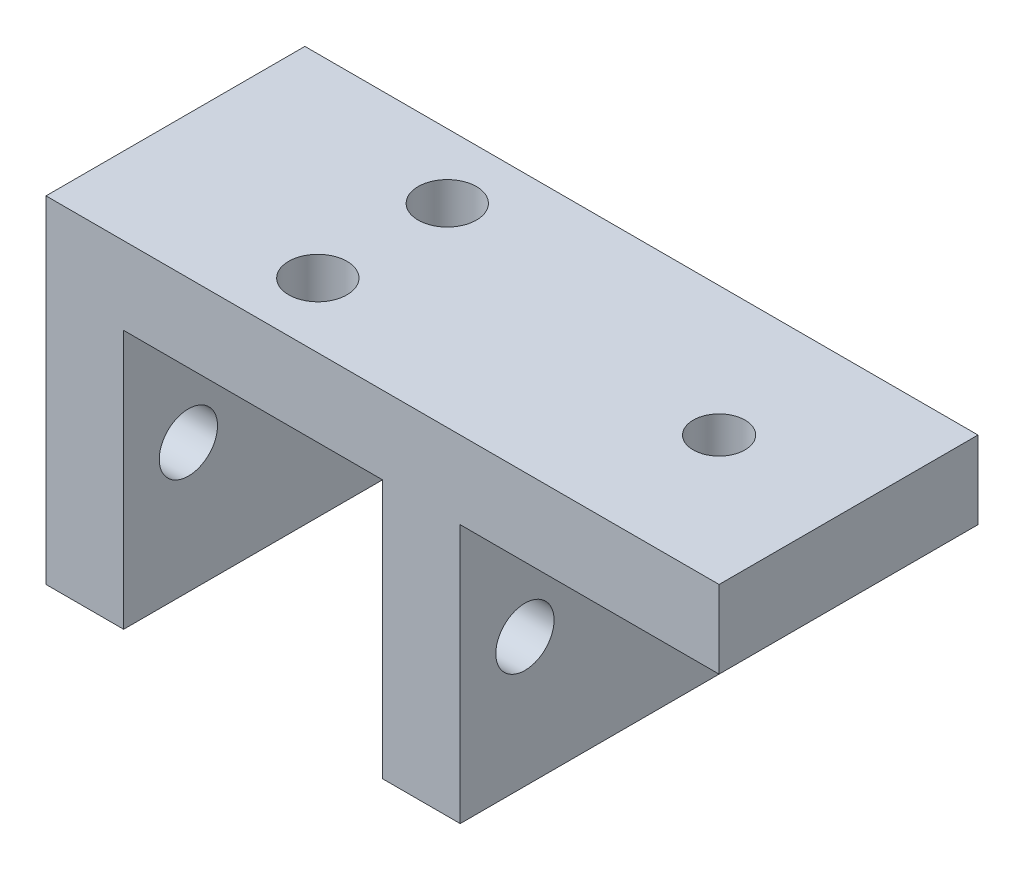
ISO-10303-21;
HEADER;
FILE_DESCRIPTION(('STEP AP214'),'2;1');
FILE_NAME('part.step','',(''),(''),'','','');
FILE_SCHEMA(('AUTOMOTIVE_DESIGN { 1 0 10303 214 1 1 1 1 }'));
ENDSEC;
DATA;
#1=APPLICATION_CONTEXT('core data for automotive mechanical design processes');
#2=APPLICATION_PROTOCOL_DEFINITION('international standard','automotive_design',2000,#1);
#3=PRODUCT_CONTEXT('',#1,'mechanical');
#4=PRODUCT('Part','Part','',(#3));
#5=PRODUCT_RELATED_PRODUCT_CATEGORY('part','',(#4));
#6=PRODUCT_DEFINITION_FORMATION('','',#4);
#7=PRODUCT_DEFINITION_CONTEXT('part definition',#1,'design');
#8=PRODUCT_DEFINITION('design','',#6,#7);
#9=PRODUCT_DEFINITION_SHAPE('','',#8);
#10=(LENGTH_UNIT() NAMED_UNIT(*) SI_UNIT(.MILLI.,.METRE.));
#11=(NAMED_UNIT(*) PLANE_ANGLE_UNIT() SI_UNIT($,.RADIAN.));
#12=(NAMED_UNIT(*) SI_UNIT($,.STERADIAN.) SOLID_ANGLE_UNIT());
#13=UNCERTAINTY_MEASURE_WITH_UNIT(LENGTH_MEASURE(1.E-05),#10,'distance_accuracy_value','');
#14=(GEOMETRIC_REPRESENTATION_CONTEXT(3) GLOBAL_UNCERTAINTY_ASSIGNED_CONTEXT((#13)) GLOBAL_UNIT_ASSIGNED_CONTEXT((#10,
#11,#12)) REPRESENTATION_CONTEXT('',''));
#15=CARTESIAN_POINT('',(0.,0.,0.));
#16=DIRECTION('',(0.,0.,1.));
#17=DIRECTION('',(1.,0.,0.));
#18=AXIS2_PLACEMENT_3D('',#15,#16,#17);
#19=CARTESIAN_POINT('',(-46.,-26.,20.));
#20=DIRECTION('',(0.,1.,0.));
#21=DIRECTION('',(0.,0.,1.));
#22=AXIS2_PLACEMENT_3D('',#19,#20,#21);
#23=PLANE('',#22);
#24=DIRECTION('',(1.,0.,0.));
#25=VECTOR('',#24,1.);
#26=CARTESIAN_POINT('',(-46.,-26.,0.));
#27=LINE('',#26,#25);
#28=CARTESIAN_POINT('',(-52.,-26.,0.));
#29=VERTEX_POINT('',#28);
#30=CARTESIAN_POINT('',(-46.,-26.,0.));
#31=VERTEX_POINT('',#30);
#32=EDGE_CURVE('E145',#29,#31,#27,.T.);
#33=ORIENTED_EDGE('',*,*,#32,.T.);
#34=DIRECTION('',(0.,0.,-1.));
#35=VECTOR('',#34,1.);
#36=CARTESIAN_POINT('',(-46.,-26.,20.));
#37=LINE('',#36,#35);
#38=CARTESIAN_POINT('',(-46.,-26.,20.));
#39=VERTEX_POINT('',#38);
#40=EDGE_CURVE('E11',#39,#31,#37,.T.);
#41=ORIENTED_EDGE('',*,*,#40,.F.);
#42=DIRECTION('',(1.,0.,0.));
#43=VECTOR('',#42,1.);
#44=CARTESIAN_POINT('',(-46.,-26.,20.));
#45=LINE('',#44,#43);
#46=CARTESIAN_POINT('',(-52.,-26.,20.));
#47=VERTEX_POINT('',#46);
#48=EDGE_CURVE('E164',#47,#39,#45,.T.);
#49=ORIENTED_EDGE('',*,*,#48,.F.);
#50=DIRECTION('',(0.,0.,-1.));
#51=VECTOR('',#50,1.);
#52=CARTESIAN_POINT('',(-52.,-26.,20.));
#53=LINE('',#52,#51);
#54=EDGE_CURVE('E141',#47,#29,#53,.T.);
#55=ORIENTED_EDGE('',*,*,#54,.T.);
#56=EDGE_LOOP('',(#33,#41,#49,#55));
#57=FACE_BOUND('',#56,.T.);
#58=ADVANCED_FACE('F37',(#57),#23,.F.);
#59=CARTESIAN_POINT('',(-46.,-6.,20.));
#60=DIRECTION('',(-1.,0.,0.));
#61=DIRECTION('',(0.,-1.,0.));
#62=AXIS2_PLACEMENT_3D('',#59,#60,#61);
#63=PLANE('',#62);
#64=CARTESIAN_POINT('',(-46.,-16.,15.));
#65=DIRECTION('',(-1.,0.,0.));
#66=DIRECTION('',(0.,-1.,0.));
#67=AXIS2_PLACEMENT_3D('',#64,#65,#66);
#68=CIRCLE('',#67,2.25);
#69=CARTESIAN_POINT('',(-46.,-18.25,15.));
#70=VERTEX_POINT('',#69);
#71=EDGE_CURVE('E149',#70,#70,#68,.T.);
#72=ORIENTED_EDGE('',*,*,#71,.T.);
#73=EDGE_LOOP('',(#72));
#74=FACE_BOUND('',#73,.T.);
#75=CARTESIAN_POINT('',(-46.,-16.,5.));
#76=DIRECTION('',(-1.,0.,0.));
#77=DIRECTION('',(0.,-1.,0.));
#78=AXIS2_PLACEMENT_3D('',#75,#76,#77);
#79=CIRCLE('',#78,2.25);
#80=CARTESIAN_POINT('',(-46.,-18.25,5.));
#81=VERTEX_POINT('',#80);
#82=EDGE_CURVE('E219',#81,#81,#79,.T.);
#83=ORIENTED_EDGE('',*,*,#82,.T.);
#84=EDGE_LOOP('',(#83));
#85=FACE_BOUND('',#84,.T.);
#86=DIRECTION('',(0.,1.,0.));
#87=VECTOR('',#86,1.);
#88=CARTESIAN_POINT('',(-46.,-6.,0.));
#89=LINE('',#88,#87);
#90=CARTESIAN_POINT('',(-46.,-6.,0.));
#91=VERTEX_POINT('',#90);
#92=EDGE_CURVE('E148',#31,#91,#89,.T.);
#93=ORIENTED_EDGE('',*,*,#92,.T.);
#94=DIRECTION('',(0.,0.,-1.));
#95=VECTOR('',#94,1.);
#96=CARTESIAN_POINT('',(-46.,-6.,20.));
#97=LINE('',#96,#95);
#98=CARTESIAN_POINT('',(-46.,-6.,20.));
#99=VERTEX_POINT('',#98);
#100=EDGE_CURVE('E45',#99,#91,#97,.T.);
#101=ORIENTED_EDGE('',*,*,#100,.F.);
#102=DIRECTION('',(0.,1.,0.));
#103=VECTOR('',#102,1.);
#104=CARTESIAN_POINT('',(-46.,-6.,20.));
#105=LINE('',#104,#103);
#106=EDGE_CURVE('E102',#39,#99,#105,.T.);
#107=ORIENTED_EDGE('',*,*,#106,.F.);
#108=ORIENTED_EDGE('',*,*,#40,.T.);
#109=EDGE_LOOP('',(#93,#101,#107,#108));
#110=FACE_BOUND('',#109,.T.);
#111=ADVANCED_FACE('F285',(#74,#85,#110),#63,.F.);
#112=CARTESIAN_POINT('',(-26.,-6.,20.));
#113=DIRECTION('',(0.,1.,0.));
#114=DIRECTION('',(-1.,0.,0.));
#115=AXIS2_PLACEMENT_3D('',#112,#113,#114);
#116=PLANE('',#115);
#117=CARTESIAN_POINT('',(-36.,-5.99999999999999,5.));
#118=DIRECTION('',(0.,-1.,0.));
#119=DIRECTION('',(0.,0.,-1.));
#120=AXIS2_PLACEMENT_3D('',#117,#118,#119);
#121=CIRCLE('',#120,2.25);
#122=CARTESIAN_POINT('',(-36.,-5.99999999999999,2.75));
#123=VERTEX_POINT('',#122);
#124=EDGE_CURVE('E242',#123,#123,#121,.T.);
#125=ORIENTED_EDGE('',*,*,#124,.F.);
#126=EDGE_LOOP('',(#125));
#127=FACE_BOUND('',#126,.T.);
#128=CARTESIAN_POINT('',(-36.,-5.99999999999999,15.));
#129=DIRECTION('',(0.,-1.,0.));
#130=DIRECTION('',(0.,0.,1.));
#131=AXIS2_PLACEMENT_3D('',#128,#129,#130);
#132=CIRCLE('',#131,2.25);
#133=CARTESIAN_POINT('',(-36.,-5.99999999999999,17.25));
#134=VERTEX_POINT('',#133);
#135=EDGE_CURVE('E238',#134,#134,#132,.T.);
#136=ORIENTED_EDGE('',*,*,#135,.F.);
#137=EDGE_LOOP('',(#136));
#138=FACE_BOUND('',#137,.T.);
#139=DIRECTION('',(1.,0.,0.));
#140=VECTOR('',#139,1.);
#141=CARTESIAN_POINT('',(-26.,-6.,0.));
#142=LINE('',#141,#140);
#143=CARTESIAN_POINT('',(-26.,-6.,0.));
#144=VERTEX_POINT('',#143);
#145=EDGE_CURVE('E151',#91,#144,#142,.T.);
#146=ORIENTED_EDGE('',*,*,#145,.T.);
#147=DIRECTION('',(0.,0.,-1.));
#148=VECTOR('',#147,1.);
#149=CARTESIAN_POINT('',(-26.,-6.,20.));
#150=LINE('',#149,#148);
#151=CARTESIAN_POINT('',(-26.,-6.,20.));
#152=VERTEX_POINT('',#151);
#153=EDGE_CURVE('E177',#152,#144,#150,.T.);
#154=ORIENTED_EDGE('',*,*,#153,.F.);
#155=DIRECTION('',(1.,0.,0.));
#156=VECTOR('',#155,1.);
#157=CARTESIAN_POINT('',(-26.,-6.,20.));
#158=LINE('',#157,#156);
#159=EDGE_CURVE('E185',#99,#152,#158,.T.);
#160=ORIENTED_EDGE('',*,*,#159,.F.);
#161=ORIENTED_EDGE('',*,*,#100,.T.);
#162=EDGE_LOOP('',(#146,#154,#160,#161));
#163=FACE_BOUND('',#162,.T.);
#164=ADVANCED_FACE('F183',(#127,#138,#163),#116,.F.);
#165=CARTESIAN_POINT('',(-26.,-26.,20.));
#166=DIRECTION('',(1.,0.,0.));
#167=DIRECTION('',(0.,1.,0.));
#168=AXIS2_PLACEMENT_3D('',#165,#166,#167);
#169=PLANE('',#168);
#170=CARTESIAN_POINT('',(-26.,-16.,15.));
#171=DIRECTION('',(1.,0.,0.));
#172=DIRECTION('',(0.,1.,0.));
#173=AXIS2_PLACEMENT_3D('',#170,#171,#172);
#174=CIRCLE('',#173,2.25);
#175=CARTESIAN_POINT('',(-26.,-13.75,15.));
#176=VERTEX_POINT('',#175);
#177=EDGE_CURVE('E213',#176,#176,#174,.T.);
#178=ORIENTED_EDGE('',*,*,#177,.T.);
#179=EDGE_LOOP('',(#178));
#180=FACE_BOUND('',#179,.T.);
#181=CARTESIAN_POINT('',(-26.,-16.,5.));
#182=DIRECTION('',(1.,0.,0.));
#183=DIRECTION('',(0.,1.,0.));
#184=AXIS2_PLACEMENT_3D('',#181,#182,#183);
#185=CIRCLE('',#184,2.25);
#186=CARTESIAN_POINT('',(-26.,-13.75,5.));
#187=VERTEX_POINT('',#186);
#188=EDGE_CURVE('E222',#187,#187,#185,.T.);
#189=ORIENTED_EDGE('',*,*,#188,.T.);
#190=EDGE_LOOP('',(#189));
#191=FACE_BOUND('',#190,.T.);
#192=DIRECTION('',(0.,-1.,0.));
#193=VECTOR('',#192,1.);
#194=CARTESIAN_POINT('',(-26.,-26.,0.));
#195=LINE('',#194,#193);
#196=CARTESIAN_POINT('',(-26.,-26.,0.));
#197=VERTEX_POINT('',#196);
#198=EDGE_CURVE('E153',#144,#197,#195,.T.);
#199=ORIENTED_EDGE('',*,*,#198,.T.);
#200=DIRECTION('',(0.,0.,-1.));
#201=VECTOR('',#200,1.);
#202=CARTESIAN_POINT('',(-26.,-26.,20.));
#203=LINE('',#202,#201);
#204=CARTESIAN_POINT('',(-26.,-26.,20.));
#205=VERTEX_POINT('',#204);
#206=EDGE_CURVE('E174',#205,#197,#203,.T.);
#207=ORIENTED_EDGE('',*,*,#206,.F.);
#208=DIRECTION('',(0.,-1.,0.));
#209=VECTOR('',#208,1.);
#210=CARTESIAN_POINT('',(-26.,-26.,20.));
#211=LINE('',#210,#209);
#212=EDGE_CURVE('E203',#152,#205,#211,.T.);
#213=ORIENTED_EDGE('',*,*,#212,.F.);
#214=ORIENTED_EDGE('',*,*,#153,.T.);
#215=EDGE_LOOP('',(#199,#207,#213,#214));
#216=FACE_BOUND('',#215,.T.);
#217=ADVANCED_FACE('F194',(#180,#191,#216),#169,.F.);
#218=CARTESIAN_POINT('',(-20.,-26.,20.));
#219=DIRECTION('',(0.,1.,0.));
#220=DIRECTION('',(-1.,0.,0.));
#221=AXIS2_PLACEMENT_3D('',#218,#219,#220);
#222=PLANE('',#221);
#223=DIRECTION('',(1.,0.,0.));
#224=VECTOR('',#223,1.);
#225=CARTESIAN_POINT('',(-20.,-26.,0.));
#226=LINE('',#225,#224);
#227=CARTESIAN_POINT('',(-20.,-26.,0.));
#228=VERTEX_POINT('',#227);
#229=EDGE_CURVE('E155',#197,#228,#226,.T.);
#230=ORIENTED_EDGE('',*,*,#229,.T.);
#231=DIRECTION('',(0.,0.,-1.));
#232=VECTOR('',#231,1.);
#233=CARTESIAN_POINT('',(-20.,-26.,20.));
#234=LINE('',#233,#232);
#235=CARTESIAN_POINT('',(-20.,-26.,20.));
#236=VERTEX_POINT('',#235);
#237=EDGE_CURVE('E171',#236,#228,#234,.T.);
#238=ORIENTED_EDGE('',*,*,#237,.F.);
#239=DIRECTION('',(1.,0.,0.));
#240=VECTOR('',#239,1.);
#241=CARTESIAN_POINT('',(-20.,-26.,20.));
#242=LINE('',#241,#240);
#243=EDGE_CURVE('E200',#205,#236,#242,.T.);
#244=ORIENTED_EDGE('',*,*,#243,.F.);
#245=ORIENTED_EDGE('',*,*,#206,.T.);
#246=EDGE_LOOP('',(#230,#238,#244,#245));
#247=FACE_BOUND('',#246,.T.);
#248=ADVANCED_FACE('F198',(#247),#222,.F.);
#249=CARTESIAN_POINT('',(-20.,-6.,20.));
#250=DIRECTION('',(-1.,0.,0.));
#251=DIRECTION('',(0.,-1.,0.));
#252=AXIS2_PLACEMENT_3D('',#249,#250,#251);
#253=PLANE('',#252);
#254=CARTESIAN_POINT('',(-20.,-16.,15.));
#255=DIRECTION('',(-1.,0.,0.));
#256=DIRECTION('',(0.,-1.,0.));
#257=AXIS2_PLACEMENT_3D('',#254,#255,#256);
#258=CIRCLE('',#257,2.25);
#259=CARTESIAN_POINT('',(-20.,-18.25,15.));
#260=VERTEX_POINT('',#259);
#261=EDGE_CURVE('E216',#260,#260,#258,.T.);
#262=ORIENTED_EDGE('',*,*,#261,.T.);
#263=EDGE_LOOP('',(#262));
#264=FACE_BOUND('',#263,.T.);
#265=CARTESIAN_POINT('',(-20.,-16.,5.));
#266=DIRECTION('',(-1.,0.,0.));
#267=DIRECTION('',(0.,-1.,0.));
#268=AXIS2_PLACEMENT_3D('',#265,#266,#267);
#269=CIRCLE('',#268,2.25);
#270=CARTESIAN_POINT('',(-20.,-18.25,5.));
#271=VERTEX_POINT('',#270);
#272=EDGE_CURVE('E225',#271,#271,#269,.T.);
#273=ORIENTED_EDGE('',*,*,#272,.T.);
#274=EDGE_LOOP('',(#273));
#275=FACE_BOUND('',#274,.T.);
#276=DIRECTION('',(0.,1.,0.));
#277=VECTOR('',#276,1.);
#278=CARTESIAN_POINT('',(-20.,-6.,0.));
#279=LINE('',#278,#277);
#280=CARTESIAN_POINT('',(-20.,-6.,0.));
#281=VERTEX_POINT('',#280);
#282=EDGE_CURVE('E157',#228,#281,#279,.T.);
#283=ORIENTED_EDGE('',*,*,#282,.T.);
#284=DIRECTION('',(0.,0.,-1.));
#285=VECTOR('',#284,1.);
#286=CARTESIAN_POINT('',(-20.,-6.,20.));
#287=LINE('',#286,#285);
#288=CARTESIAN_POINT('',(-20.,-6.,20.));
#289=VERTEX_POINT('',#288);
#290=EDGE_CURVE('E168',#289,#281,#287,.T.);
#291=ORIENTED_EDGE('',*,*,#290,.F.);
#292=DIRECTION('',(0.,1.,0.));
#293=VECTOR('',#292,1.);
#294=CARTESIAN_POINT('',(-20.,-6.,20.));
#295=LINE('',#294,#293);
#296=EDGE_CURVE('E202',#236,#289,#295,.T.);
#297=ORIENTED_EDGE('',*,*,#296,.F.);
#298=ORIENTED_EDGE('',*,*,#237,.T.);
#299=EDGE_LOOP('',(#283,#291,#297,#298));
#300=FACE_BOUND('',#299,.T.);
#301=ADVANCED_FACE('F265',(#264,#275,#300),#253,.F.);
#302=CARTESIAN_POINT('',(-20.,-6.,20.));
#303=DIRECTION('',(0.,1.,0.));
#304=DIRECTION('',(0.,0.,1.));
#305=AXIS2_PLACEMENT_3D('',#302,#303,#304);
#306=PLANE('',#305);
#307=CARTESIAN_POINT('',(-10.,-6.,9.99999999999999));
#308=DIRECTION('',(0.,-1.,0.));
#309=DIRECTION('',(0.,0.,-1.));
#310=AXIS2_PLACEMENT_3D('',#307,#308,#309);
#311=CIRCLE('',#310,2.);
#312=CARTESIAN_POINT('',(-10.,-6.,7.99999999999999));
#313=VERTEX_POINT('',#312);
#314=EDGE_CURVE('E247',#313,#313,#311,.T.);
#315=ORIENTED_EDGE('',*,*,#314,.F.);
#316=EDGE_LOOP('',(#315));
#317=FACE_BOUND('',#316,.T.);
#318=DIRECTION('',(1.,0.,0.));
#319=VECTOR('',#318,1.);
#320=CARTESIAN_POINT('',(-20.,-6.,0.));
#321=LINE('',#320,#319);
#322=CARTESIAN_POINT('',(0.,-6.,0.));
#323=VERTEX_POINT('',#322);
#324=EDGE_CURVE('E159',#281,#323,#321,.T.);
#325=ORIENTED_EDGE('',*,*,#324,.T.);
#326=DIRECTION('',(0.,0.,-1.));
#327=VECTOR('',#326,1.);
#328=CARTESIAN_POINT('',(0.,-6.,20.));
#329=LINE('',#328,#327);
#330=CARTESIAN_POINT('',(0.,-6.,20.));
#331=VERTEX_POINT('',#330);
#332=EDGE_CURVE('E136',#331,#323,#329,.T.);
#333=ORIENTED_EDGE('',*,*,#332,.F.);
#334=DIRECTION('',(1.,0.,0.));
#335=VECTOR('',#334,1.);
#336=CARTESIAN_POINT('',(-20.,-6.,20.));
#337=LINE('',#336,#335);
#338=EDGE_CURVE('E127',#289,#331,#337,.T.);
#339=ORIENTED_EDGE('',*,*,#338,.F.);
#340=ORIENTED_EDGE('',*,*,#290,.T.);
#341=EDGE_LOOP('',(#325,#333,#339,#340));
#342=FACE_BOUND('',#341,.T.);
#343=ADVANCED_FACE('F262',(#317,#342),#306,.F.);
#344=CARTESIAN_POINT('',(0.,-6.,20.));
#345=DIRECTION('',(-1.,0.,0.));
#346=DIRECTION('',(0.,-1.,0.));
#347=AXIS2_PLACEMENT_3D('',#344,#345,#346);
#348=PLANE('',#347);
#349=DIRECTION('',(0.,1.,0.));
#350=VECTOR('',#349,1.);
#351=CARTESIAN_POINT('',(0.,-6.,0.));
#352=LINE('',#351,#350);
#353=CARTESIAN_POINT('',(0.,0.,0.));
#354=VERTEX_POINT('',#353);
#355=EDGE_CURVE('E135',#323,#354,#352,.T.);
#356=ORIENTED_EDGE('',*,*,#355,.T.);
#357=DIRECTION('',(0.,0.,-1.));
#358=VECTOR('',#357,1.);
#359=CARTESIAN_POINT('',(0.,0.,20.));
#360=LINE('',#359,#358);
#361=CARTESIAN_POINT('',(0.,0.,20.));
#362=VERTEX_POINT('',#361);
#363=EDGE_CURVE('E132',#362,#354,#360,.T.);
#364=ORIENTED_EDGE('',*,*,#363,.F.);
#365=DIRECTION('',(0.,1.,0.));
#366=VECTOR('',#365,1.);
#367=CARTESIAN_POINT('',(0.,-6.,20.));
#368=LINE('',#367,#366);
#369=EDGE_CURVE('E121',#331,#362,#368,.T.);
#370=ORIENTED_EDGE('',*,*,#369,.F.);
#371=ORIENTED_EDGE('',*,*,#332,.T.);
#372=EDGE_LOOP('',(#356,#364,#370,#371));
#373=FACE_BOUND('',#372,.T.);
#374=ADVANCED_FACE('F133',(#373),#348,.F.);
#375=CARTESIAN_POINT('',(-52.,0.,20.));
#376=DIRECTION('',(0.,-1.,0.));
#377=DIRECTION('',(0.,0.,-1.));
#378=AXIS2_PLACEMENT_3D('',#375,#376,#377);
#379=PLANE('',#378);
#380=CARTESIAN_POINT('',(-10.,0.,9.99999999999999));
#381=DIRECTION('',(0.,-1.,0.));
#382=DIRECTION('',(0.,0.,-1.));
#383=AXIS2_PLACEMENT_3D('',#380,#381,#382);
#384=CIRCLE('',#383,2.);
#385=CARTESIAN_POINT('',(-10.,0.,7.99999999999999));
#386=VERTEX_POINT('',#385);
#387=EDGE_CURVE('E239',#386,#386,#384,.T.);
#388=ORIENTED_EDGE('',*,*,#387,.T.);
#389=EDGE_LOOP('',(#388));
#390=FACE_BOUND('',#389,.T.);
#391=CARTESIAN_POINT('',(-36.,0.,5.));
#392=DIRECTION('',(0.,-1.,0.));
#393=DIRECTION('',(0.,0.,-1.));
#394=AXIS2_PLACEMENT_3D('',#391,#392,#393);
#395=CIRCLE('',#394,2.25);
#396=CARTESIAN_POINT('',(-36.,0.,2.75));
#397=VERTEX_POINT('',#396);
#398=EDGE_CURVE('E232',#397,#397,#395,.T.);
#399=ORIENTED_EDGE('',*,*,#398,.T.);
#400=EDGE_LOOP('',(#399));
#401=FACE_BOUND('',#400,.T.);
#402=CARTESIAN_POINT('',(-36.,0.,15.));
#403=DIRECTION('',(0.,-1.,0.));
#404=DIRECTION('',(0.,0.,1.));
#405=AXIS2_PLACEMENT_3D('',#402,#403,#404);
#406=CIRCLE('',#405,2.25);
#407=CARTESIAN_POINT('',(-36.,0.,17.25));
#408=VERTEX_POINT('',#407);
#409=EDGE_CURVE('E235',#408,#408,#406,.T.);
#410=ORIENTED_EDGE('',*,*,#409,.T.);
#411=EDGE_LOOP('',(#410));
#412=FACE_BOUND('',#411,.T.);
#413=DIRECTION('',(-1.,0.,0.));
#414=VECTOR('',#413,1.);
#415=CARTESIAN_POINT('',(-52.,0.,0.));
#416=LINE('',#415,#414);
#417=CARTESIAN_POINT('',(-52.,0.,0.));
#418=VERTEX_POINT('',#417);
#419=EDGE_CURVE('E88',#354,#418,#416,.T.);
#420=ORIENTED_EDGE('',*,*,#419,.T.);
#421=DIRECTION('',(0.,0.,-1.));
#422=VECTOR('',#421,1.);
#423=CARTESIAN_POINT('',(-52.,0.,20.));
#424=LINE('',#423,#422);
#425=CARTESIAN_POINT('',(-52.,0.,20.));
#426=VERTEX_POINT('',#425);
#427=EDGE_CURVE('E137',#426,#418,#424,.T.);
#428=ORIENTED_EDGE('',*,*,#427,.F.);
#429=DIRECTION('',(-1.,0.,0.));
#430=VECTOR('',#429,1.);
#431=CARTESIAN_POINT('',(-52.,0.,20.));
#432=LINE('',#431,#430);
#433=EDGE_CURVE('E125',#362,#426,#432,.T.);
#434=ORIENTED_EDGE('',*,*,#433,.F.);
#435=ORIENTED_EDGE('',*,*,#363,.T.);
#436=EDGE_LOOP('',(#420,#428,#434,#435));
#437=FACE_BOUND('',#436,.T.);
#438=ADVANCED_FACE('F139',(#390,#401,#412,#437),#379,.F.);
#439=CARTESIAN_POINT('',(-52.,-26.,20.));
#440=DIRECTION('',(1.,0.,0.));
#441=DIRECTION('',(0.,0.,-1.));
#442=AXIS2_PLACEMENT_3D('',#439,#440,#441);
#443=PLANE('',#442);
#444=CARTESIAN_POINT('',(-52.,-16.,15.));
#445=DIRECTION('',(1.,0.,0.));
#446=DIRECTION('',(0.,1.,0.));
#447=AXIS2_PLACEMENT_3D('',#444,#445,#446);
#448=CIRCLE('',#447,2.25);
#449=CARTESIAN_POINT('',(-52.,-13.75,15.));
#450=VERTEX_POINT('',#449);
#451=EDGE_CURVE('E228',#450,#450,#448,.T.);
#452=ORIENTED_EDGE('',*,*,#451,.T.);
#453=EDGE_LOOP('',(#452));
#454=FACE_BOUND('',#453,.T.);
#455=CARTESIAN_POINT('',(-52.,-16.,5.));
#456=DIRECTION('',(1.,0.,0.));
#457=DIRECTION('',(0.,-1.,0.));
#458=AXIS2_PLACEMENT_3D('',#455,#456,#457);
#459=CIRCLE('',#458,2.25);
#460=CARTESIAN_POINT('',(-52.,-18.25,5.));
#461=VERTEX_POINT('',#460);
#462=EDGE_CURVE('E229',#461,#461,#459,.T.);
#463=ORIENTED_EDGE('',*,*,#462,.T.);
#464=EDGE_LOOP('',(#463));
#465=FACE_BOUND('',#464,.T.);
#466=DIRECTION('',(0.,-1.,0.));
#467=VECTOR('',#466,1.);
#468=CARTESIAN_POINT('',(-52.,-26.,0.));
#469=LINE('',#468,#467);
#470=EDGE_CURVE('E94',#418,#29,#469,.T.);
#471=ORIENTED_EDGE('',*,*,#470,.T.);
#472=ORIENTED_EDGE('',*,*,#54,.F.);
#473=DIRECTION('',(0.,-1.,0.));
#474=VECTOR('',#473,1.);
#475=CARTESIAN_POINT('',(-52.,-26.,20.));
#476=LINE('',#475,#474);
#477=EDGE_CURVE('E53',#426,#47,#476,.T.);
#478=ORIENTED_EDGE('',*,*,#477,.F.);
#479=ORIENTED_EDGE('',*,*,#427,.T.);
#480=EDGE_LOOP('',(#471,#472,#478,#479));
#481=FACE_BOUND('',#480,.T.);
#482=ADVANCED_FACE('F272',(#454,#465,#481),#443,.F.);
#483=CARTESIAN_POINT('',(0.,0.,20.));
#484=DIRECTION('',(0.,0.,-1.));
#485=DIRECTION('',(-1.,0.,0.));
#486=AXIS2_PLACEMENT_3D('',#483,#484,#485);
#487=PLANE('',#486);
#488=ORIENTED_EDGE('',*,*,#48,.T.);
#489=ORIENTED_EDGE('',*,*,#106,.T.);
#490=ORIENTED_EDGE('',*,*,#159,.T.);
#491=ORIENTED_EDGE('',*,*,#212,.T.);
#492=ORIENTED_EDGE('',*,*,#243,.T.);
#493=ORIENTED_EDGE('',*,*,#296,.T.);
#494=ORIENTED_EDGE('',*,*,#338,.T.);
#495=ORIENTED_EDGE('',*,*,#369,.T.);
#496=ORIENTED_EDGE('',*,*,#433,.T.);
#497=ORIENTED_EDGE('',*,*,#477,.T.);
#498=EDGE_LOOP('',(#488,#489,#490,#491,#492,#493,#494,#495,#496,#497));
#499=FACE_BOUND('',#498,.T.);
#500=ADVANCED_FACE('F123',(#499),#487,.F.);
#501=CARTESIAN_POINT('',(0.,0.,0.));
#502=DIRECTION('',(0.,0.,-1.));
#503=DIRECTION('',(-1.,0.,0.));
#504=AXIS2_PLACEMENT_3D('',#501,#502,#503);
#505=PLANE('',#504);
#506=ORIENTED_EDGE('',*,*,#32,.F.);
#507=ORIENTED_EDGE('',*,*,#470,.F.);
#508=ORIENTED_EDGE('',*,*,#419,.F.);
#509=ORIENTED_EDGE('',*,*,#355,.F.);
#510=ORIENTED_EDGE('',*,*,#324,.F.);
#511=ORIENTED_EDGE('',*,*,#282,.F.);
#512=ORIENTED_EDGE('',*,*,#229,.F.);
#513=ORIENTED_EDGE('',*,*,#198,.F.);
#514=ORIENTED_EDGE('',*,*,#145,.F.);
#515=ORIENTED_EDGE('',*,*,#92,.F.);
#516=EDGE_LOOP('',(#506,#507,#508,#509,#510,#511,#512,#513,#514,#515));
#517=FACE_BOUND('',#516,.T.);
#518=ADVANCED_FACE('F189',(#517),#505,.T.);
#519=CARTESIAN_POINT('',(-52.,-16.,5.));
#520=DIRECTION('',(1.,0.,0.));
#521=DIRECTION('',(0.,1.,0.));
#522=AXIS2_PLACEMENT_3D('',#519,#520,#521);
#523=CYLINDRICAL_SURFACE('',#522,2.25);
#524=ORIENTED_EDGE('',*,*,#462,.F.);
#525=EDGE_LOOP('',(#524));
#526=FACE_BOUND('',#525,.T.);
#527=ORIENTED_EDGE('',*,*,#82,.F.);
#528=EDGE_LOOP('',(#527));
#529=FACE_BOUND('',#528,.T.);
#530=ADVANCED_FACE('F363',(#526,#529),#523,.F.);
#531=CARTESIAN_POINT('',(-52.,-16.,15.));
#532=DIRECTION('',(1.,0.,0.));
#533=DIRECTION('',(0.,1.,0.));
#534=AXIS2_PLACEMENT_3D('',#531,#532,#533);
#535=CYLINDRICAL_SURFACE('',#534,2.25);
#536=ORIENTED_EDGE('',*,*,#451,.F.);
#537=EDGE_LOOP('',(#536));
#538=FACE_BOUND('',#537,.T.);
#539=ORIENTED_EDGE('',*,*,#71,.F.);
#540=EDGE_LOOP('',(#539));
#541=FACE_BOUND('',#540,.T.);
#542=ADVANCED_FACE('F355',(#538,#541),#535,.F.);
#543=ORIENTED_EDGE('',*,*,#272,.F.);
#544=EDGE_LOOP('',(#543));
#545=FACE_BOUND('',#544,.T.);
#546=ORIENTED_EDGE('',*,*,#188,.F.);
#547=EDGE_LOOP('',(#546));
#548=FACE_BOUND('',#547,.T.);
#549=ADVANCED_FACE('F352',(#545,#548),#523,.F.);
#550=ORIENTED_EDGE('',*,*,#261,.F.);
#551=EDGE_LOOP('',(#550));
#552=FACE_BOUND('',#551,.T.);
#553=ORIENTED_EDGE('',*,*,#177,.F.);
#554=EDGE_LOOP('',(#553));
#555=FACE_BOUND('',#554,.T.);
#556=ADVANCED_FACE('F343',(#552,#555),#535,.F.);
#557=CARTESIAN_POINT('',(-36.,0.,15.));
#558=DIRECTION('',(0.,-1.,0.));
#559=DIRECTION('',(0.,0.,-1.));
#560=AXIS2_PLACEMENT_3D('',#557,#558,#559);
#561=CYLINDRICAL_SURFACE('',#560,2.25);
#562=ORIENTED_EDGE('',*,*,#409,.F.);
#563=EDGE_LOOP('',(#562));
#564=FACE_BOUND('',#563,.T.);
#565=ORIENTED_EDGE('',*,*,#135,.T.);
#566=EDGE_LOOP('',(#565));
#567=FACE_BOUND('',#566,.T.);
#568=ADVANCED_FACE('F336',(#564,#567),#561,.F.);
#569=CARTESIAN_POINT('',(-36.,0.,5.));
#570=DIRECTION('',(0.,-1.,0.));
#571=DIRECTION('',(0.,0.,-1.));
#572=AXIS2_PLACEMENT_3D('',#569,#570,#571);
#573=CYLINDRICAL_SURFACE('',#572,2.25);
#574=ORIENTED_EDGE('',*,*,#398,.F.);
#575=EDGE_LOOP('',(#574));
#576=FACE_BOUND('',#575,.T.);
#577=ORIENTED_EDGE('',*,*,#124,.T.);
#578=EDGE_LOOP('',(#577));
#579=FACE_BOUND('',#578,.T.);
#580=ADVANCED_FACE('F258',(#576,#579),#573,.F.);
#581=CARTESIAN_POINT('',(-10.,0.,9.99999999999999));
#582=DIRECTION('',(0.,-1.,0.));
#583=DIRECTION('',(0.,0.,-1.));
#584=AXIS2_PLACEMENT_3D('',#581,#582,#583);
#585=CYLINDRICAL_SURFACE('',#584,2.);
#586=ORIENTED_EDGE('',*,*,#387,.F.);
#587=EDGE_LOOP('',(#586));
#588=FACE_BOUND('',#587,.T.);
#589=ORIENTED_EDGE('',*,*,#314,.T.);
#590=EDGE_LOOP('',(#589));
#591=FACE_BOUND('',#590,.T.);
#592=ADVANCED_FACE('F255',(#588,#591),#585,.F.);
#593=CLOSED_SHELL('',(#58,#111,#164,#217,#248,#301,#343,#374,#438,#482,#500,#518,#530,#542,#549,
#556,#568,#580,#592));
#594=MANIFOLD_SOLID_BREP('B2',#593);
#595=ADVANCED_BREP_SHAPE_REPRESENTATION('',(#18,#594),#14);
#596=SHAPE_DEFINITION_REPRESENTATION(#9,#595);
ENDSEC;
END-ISO-10303-21;
